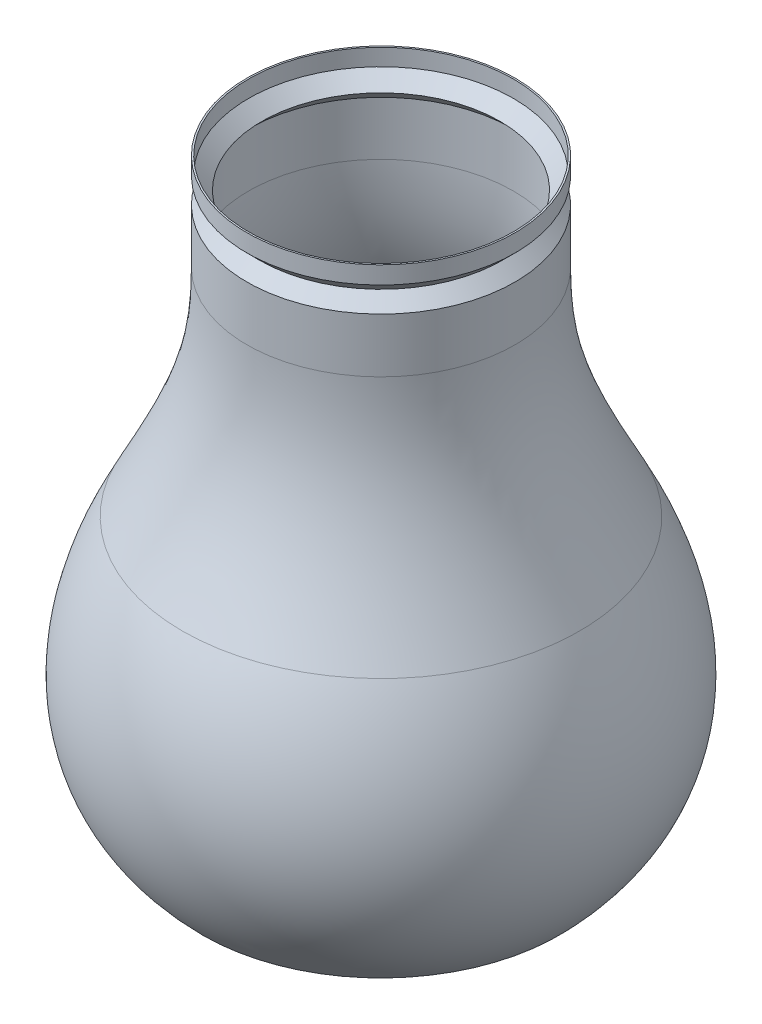
ISO-10303-21;
HEADER;
FILE_DESCRIPTION(('STEP AP214'),'2;1');
FILE_NAME('part.step','',(''),(''),'','','');
FILE_SCHEMA(('AUTOMOTIVE_DESIGN { 1 0 10303 214 1 1 1 1 }'));
ENDSEC;
DATA;
#1=APPLICATION_CONTEXT('core data for automotive mechanical design processes');
#2=APPLICATION_PROTOCOL_DEFINITION('international standard','automotive_design',2000,#1);
#3=PRODUCT_CONTEXT('',#1,'mechanical');
#4=PRODUCT('Part','Part','',(#3));
#5=PRODUCT_RELATED_PRODUCT_CATEGORY('part','',(#4));
#6=PRODUCT_DEFINITION_FORMATION('','',#4);
#7=PRODUCT_DEFINITION_CONTEXT('part definition',#1,'design');
#8=PRODUCT_DEFINITION('design','',#6,#7);
#9=PRODUCT_DEFINITION_SHAPE('','',#8);
#10=(LENGTH_UNIT() NAMED_UNIT(*) SI_UNIT(.MILLI.,.METRE.));
#11=(NAMED_UNIT(*) PLANE_ANGLE_UNIT() SI_UNIT($,.RADIAN.));
#12=(NAMED_UNIT(*) SI_UNIT($,.STERADIAN.) SOLID_ANGLE_UNIT());
#13=UNCERTAINTY_MEASURE_WITH_UNIT(LENGTH_MEASURE(1.E-05),#10,'distance_accuracy_value','');
#14=(GEOMETRIC_REPRESENTATION_CONTEXT(3) GLOBAL_UNCERTAINTY_ASSIGNED_CONTEXT((#13)) GLOBAL_UNIT_ASSIGNED_CONTEXT((#10,
#11,#12)) REPRESENTATION_CONTEXT('',''));
#15=CARTESIAN_POINT('',(0.,0.,0.));
#16=DIRECTION('',(0.,0.,1.));
#17=DIRECTION('',(1.,0.,0.));
#18=AXIS2_PLACEMENT_3D('',#15,#16,#17);
#19=CARTESIAN_POINT('',(0.,102.00575460953,0.));
#20=DIRECTION('',(0.,1.,0.));
#21=DIRECTION('',(0.,0.,1.));
#22=AXIS2_PLACEMENT_3D('',#19,#20,#21);
#23=PLANE('',#22);
#24=CARTESIAN_POINT('',(0.,102.00575460953,0.));
#25=DIRECTION('',(0.,-1.,0.));
#26=DIRECTION('',(0.,0.,-1.));
#27=AXIS2_PLACEMENT_3D('',#24,#25,#26);
#28=CIRCLE('',#27,32.6208653821263);
#29=CARTESIAN_POINT('',(0.,102.00575460953,-32.6208653821263));
#30=VERTEX_POINT('',#29);
#31=EDGE_CURVE('E10',#30,#30,#28,.T.);
#32=ORIENTED_EDGE('',*,*,#31,.T.);
#33=EDGE_LOOP('',(#32));
#34=FACE_BOUND('',#33,.T.);
#35=CARTESIAN_POINT('',(0.,102.00575460953,0.));
#36=DIRECTION('',(0.,-1.,0.));
#37=DIRECTION('',(0.,0.,-1.));
#38=AXIS2_PLACEMENT_3D('',#35,#36,#37);
#39=CIRCLE('',#38,33.0208653821263);
#40=CARTESIAN_POINT('',(0.,102.00575460953,-33.0208653821263));
#41=VERTEX_POINT('',#40);
#42=EDGE_CURVE('E119',#41,#41,#39,.T.);
#43=ORIENTED_EDGE('',*,*,#42,.F.);
#44=EDGE_LOOP('',(#43));
#45=FACE_BOUND('',#44,.T.);
#46=ADVANCED_FACE('F35',(#34,#45),#23,.T.);
#47=CARTESIAN_POINT('',(0.,0.,0.));
#48=DIRECTION('',(0.,-1.,0.));
#49=DIRECTION('',(0.,0.,-1.));
#50=AXIS2_PLACEMENT_3D('',#47,#48,#49);
#51=CYLINDRICAL_SURFACE('',#50,32.6208653821263);
#52=CARTESIAN_POINT('',(0.,97.85523123935,0.));
#53=DIRECTION('',(0.,1.,0.));
#54=DIRECTION('',(0.,0.,1.));
#55=AXIS2_PLACEMENT_3D('',#52,#53,#54);
#56=CIRCLE('',#55,32.6208653821263);
#57=CARTESIAN_POINT('',(0.,97.85523123935,32.6208653821263));
#58=VERTEX_POINT('',#57);
#59=EDGE_CURVE('E42',#58,#58,#56,.F.);
#60=ORIENTED_EDGE('',*,*,#59,.T.);
#61=EDGE_LOOP('',(#60));
#62=FACE_BOUND('',#61,.T.);
#63=ORIENTED_EDGE('',*,*,#31,.F.);
#64=EDGE_LOOP('',(#63));
#65=FACE_BOUND('',#64,.T.);
#66=ADVANCED_FACE('F109',(#62,#65),#51,.F.);
#67=CARTESIAN_POINT('',(0.,97.9723885268754,0.));
#68=DIRECTION('',(0.,1.,0.));
#69=DIRECTION('',(0.,0.,1.));
#70=AXIS2_PLACEMENT_3D('',#67,#68,#69);
#71=CONICAL_SURFACE('',#70,32.7380226696517,0.785398163397451);
#72=CARTESIAN_POINT('',(0.,94.5933034389735,0.));
#73=DIRECTION('',(0.,-1.,0.));
#74=DIRECTION('',(0.,0.,-1.));
#75=AXIS2_PLACEMENT_3D('',#72,#73,#74);
#76=CIRCLE('',#75,29.3589375817498);
#77=CARTESIAN_POINT('',(0.,94.5933034389735,-29.3589375817498));
#78=VERTEX_POINT('',#77);
#79=EDGE_CURVE('E47',#78,#78,#76,.T.);
#80=ORIENTED_EDGE('',*,*,#79,.T.);
#81=EDGE_LOOP('',(#80));
#82=FACE_BOUND('',#81,.T.);
#83=ORIENTED_EDGE('',*,*,#59,.F.);
#84=EDGE_LOOP('',(#83));
#85=FACE_BOUND('',#84,.T.);
#86=ADVANCED_FACE('F113',(#82,#85),#71,.F.);
#87=CARTESIAN_POINT('',(0.,94.3104607264989,0.));
#88=DIRECTION('',(0.,-1.,0.));
#89=DIRECTION('',(0.,0.,-1.));
#90=AXIS2_PLACEMENT_3D('',#87,#88,#89);
#91=CONICAL_SURFACE('',#90,29.6417802942244,0.785398163397447);
#92=CARTESIAN_POINT('',(0.,91.3313756385971,0.));
#93=DIRECTION('',(0.,-1.,0.));
#94=DIRECTION('',(0.,0.,-1.));
#95=AXIS2_PLACEMENT_3D('',#92,#93,#94);
#96=CIRCLE('',#95,32.6208653821263);
#97=CARTESIAN_POINT('',(0.,91.3313756385971,-32.6208653821263));
#98=VERTEX_POINT('',#97);
#99=EDGE_CURVE('E153',#98,#98,#96,.T.);
#100=ORIENTED_EDGE('',*,*,#99,.T.);
#101=EDGE_LOOP('',(#100));
#102=FACE_BOUND('',#101,.T.);
#103=ORIENTED_EDGE('',*,*,#79,.F.);
#104=EDGE_LOOP('',(#103));
#105=FACE_BOUND('',#104,.T.);
#106=ADVANCED_FACE('F163',(#102,#105),#91,.F.);
#107=CARTESIAN_POINT('',(0.,0.,0.));
#108=DIRECTION('',(0.,-1.,0.));
#109=DIRECTION('',(0.,0.,-1.));
#110=AXIS2_PLACEMENT_3D('',#107,#108,#109);
#111=CYLINDRICAL_SURFACE('',#110,32.6208653821263);
#112=CARTESIAN_POINT('',(0.,78.1039386954683,0.));
#113=DIRECTION('',(0.,-1.,0.));
#114=DIRECTION('',(0.,0.,-1.));
#115=AXIS2_PLACEMENT_3D('',#112,#113,#114);
#116=CIRCLE('',#115,32.6208653821263);
#117=CARTESIAN_POINT('',(0.,78.1039386954683,-32.6208653821263));
#118=VERTEX_POINT('',#117);
#119=EDGE_CURVE('E149',#118,#118,#116,.T.);
#120=ORIENTED_EDGE('',*,*,#119,.T.);
#121=EDGE_LOOP('',(#120));
#122=FACE_BOUND('',#121,.T.);
#123=ORIENTED_EDGE('',*,*,#99,.F.);
#124=EDGE_LOOP('',(#123));
#125=FACE_BOUND('',#124,.T.);
#126=ADVANCED_FACE('F165',(#122,#125),#111,.F.);
#127=CARTESIAN_POINT('',(33.0208653821263,78.1039386954683,0.));
#128=CARTESIAN_POINT('',(33.0208653821263,72.2834429102533,0.));
#129=CARTESIAN_POINT('',(34.2475435519663,53.9325972752835,0.));
#130=CARTESIAN_POINT('',(42.2309766532484,37.7958519504051,0.));
#131=CARTESIAN_POINT('',(48.9066919760712,25.0009727942814,0.));
#132=B_SPLINE_CURVE_WITH_KNOTS('',3,(#127,#128,#129,#130,#131),.UNSPECIFIED.,.F.,.F.,(4,1,4),
(0.,0.295134447110352,1.),.UNSPECIFIED.);
#133=CARTESIAN_POINT('',(0.,0.,0.));
#134=DIRECTION('',(0.,-1.,0.));
#135=AXIS1_PLACEMENT('',#133,#134);
#136=SURFACE_OF_REVOLUTION('',#132,#135);
#137=OFFSET_SURFACE('',#136,-0.4,.F.);
#138=CARTESIAN_POINT('',(0.,24.8159436422272,0.));
#139=DIRECTION('',(0.,-1.,0.));
#140=DIRECTION('',(1.,0.,0.));
#141=AXIS2_PLACEMENT_3D('',#138,#139,#140);
#142=CIRCLE('',#141,48.5520594720757);
#143=CARTESIAN_POINT('',(48.5520594720757,24.8159436422272,0.));
#144=VERTEX_POINT('',#143);
#145=EDGE_CURVE('E121',#144,#144,#142,.T.);
#146=ORIENTED_EDGE('',*,*,#145,.T.);
#147=EDGE_LOOP('',(#146));
#148=FACE_BOUND('',#147,.T.);
#149=ORIENTED_EDGE('',*,*,#119,.F.);
#150=EDGE_LOOP('',(#149));
#151=FACE_BOUND('',#150,.T.);
#152=ADVANCED_FACE('F73',(#148,#151),#137,.F.);
#153=CARTESIAN_POINT('',(48.9066919760712,25.0009727942814,0.));
#154=CARTESIAN_POINT('',(57.9528492630896,7.66283242766259,0.));
#155=CARTESIAN_POINT('',(61.1977338848295,-19.9772439432785,0.));
#156=CARTESIAN_POINT('',(49.9064141781168,-36.3791762064389,0.));
#157=CARTESIAN_POINT('',(43.8041132184263,-42.4814771661295,0.));
#158=B_SPLINE_CURVE_WITH_KNOTS('',3,(#153,#154,#155,#156,#157),.UNSPECIFIED.,.F.,.F.,(4,1,4),
(0.,0.5,1.),.UNSPECIFIED.);
#159=CARTESIAN_POINT('',(0.,0.,0.));
#160=DIRECTION('',(0.,-1.,0.));
#161=AXIS1_PLACEMENT('',#159,#160);
#162=SURFACE_OF_REVOLUTION('',#158,#161);
#163=OFFSET_SURFACE('',#162,-0.4,.F.);
#164=CARTESIAN_POINT('',(0.,-42.08147716613,0.));
#165=DIRECTION('',(0.,-1.,0.));
#166=DIRECTION('',(0.,0.,-1.));
#167=AXIS2_PLACEMENT_3D('',#164,#165,#166);
#168=CIRCLE('',#167,43.6381121545532);
#169=CARTESIAN_POINT('',(0.,-42.08147716613,-43.6381121545532));
#170=VERTEX_POINT('',#169);
#171=EDGE_CURVE('E51',#170,#170,#168,.T.);
#172=ORIENTED_EDGE('',*,*,#171,.T.);
#173=EDGE_LOOP('',(#172));
#174=FACE_BOUND('',#173,.T.);
#175=ORIENTED_EDGE('',*,*,#145,.F.);
#176=EDGE_LOOP('',(#175));
#177=FACE_BOUND('',#176,.T.);
#178=ADVANCED_FACE('F75',(#174,#177),#163,.F.);
#179=CARTESIAN_POINT('',(43.8041132184263,-42.08147716613,0.));
#180=DIRECTION('',(0.,1.,0.));
#181=DIRECTION('',(0.,0.,1.));
#182=AXIS2_PLACEMENT_3D('',#179,#180,#181);
#183=PLANE('',#182);
#184=ORIENTED_EDGE('',*,*,#171,.F.);
#185=EDGE_LOOP('',(#184));
#186=FACE_BOUND('',#185,.T.);
#187=ADVANCED_FACE('F78',(#186),#183,.T.);
#188=CARTESIAN_POINT('',(0.,0.,0.));
#189=DIRECTION('',(0.,-1.,0.));
#190=DIRECTION('',(0.,0.,-1.));
#191=AXIS2_PLACEMENT_3D('',#188,#189,#190);
#192=CYLINDRICAL_SURFACE('',#191,33.0208653821263);
#193=CARTESIAN_POINT('',(0.,97.6895458144008,0.));
#194=DIRECTION('',(0.,-1.,0.));
#195=DIRECTION('',(0.,0.,-1.));
#196=AXIS2_PLACEMENT_3D('',#193,#194,#195);
#197=CIRCLE('',#196,33.0208653821263);
#198=CARTESIAN_POINT('',(0.,97.6895458144008,-33.0208653821263));
#199=VERTEX_POINT('',#198);
#200=EDGE_CURVE('E38',#199,#199,#197,.T.);
#201=ORIENTED_EDGE('',*,*,#200,.F.);
#202=EDGE_LOOP('',(#201));
#203=FACE_BOUND('',#202,.T.);
#204=ORIENTED_EDGE('',*,*,#42,.T.);
#205=EDGE_LOOP('',(#204));
#206=FACE_BOUND('',#205,.T.);
#207=ADVANCED_FACE('F87',(#203,#206),#192,.T.);
#208=CARTESIAN_POINT('',(0.,97.6895458144008,0.));
#209=DIRECTION('',(0.,1.,0.));
#210=DIRECTION('',(0.,0.,1.));
#211=AXIS2_PLACEMENT_3D('',#208,#209,#210);
#212=CONICAL_SURFACE('',#211,33.0208653821263,0.785398163397451);
#213=CARTESIAN_POINT('',(0.,94.5933034389735,0.));
#214=DIRECTION('',(0.,-1.,0.));
#215=DIRECTION('',(0.,0.,-1.));
#216=AXIS2_PLACEMENT_3D('',#213,#214,#215);
#217=CIRCLE('',#216,29.924623006699);
#218=CARTESIAN_POINT('',(0.,94.5933034389735,-29.924623006699));
#219=VERTEX_POINT('',#218);
#220=EDGE_CURVE('E123',#219,#219,#217,.T.);
#221=ORIENTED_EDGE('',*,*,#220,.F.);
#222=EDGE_LOOP('',(#221));
#223=FACE_BOUND('',#222,.T.);
#224=ORIENTED_EDGE('',*,*,#200,.T.);
#225=EDGE_LOOP('',(#224));
#226=FACE_BOUND('',#225,.T.);
#227=ADVANCED_FACE('F98',(#223,#226),#212,.T.);
#228=CARTESIAN_POINT('',(0.,94.5933034389735,0.));
#229=DIRECTION('',(0.,-1.,0.));
#230=DIRECTION('',(0.,0.,-1.));
#231=AXIS2_PLACEMENT_3D('',#228,#229,#230);
#232=CONICAL_SURFACE('',#231,29.924623006699,0.785398163397447);
#233=CARTESIAN_POINT('',(0.,91.4970610635463,0.));
#234=DIRECTION('',(0.,-1.,0.));
#235=DIRECTION('',(0.,0.,-1.));
#236=AXIS2_PLACEMENT_3D('',#233,#234,#235);
#237=CIRCLE('',#236,33.0208653821263);
#238=CARTESIAN_POINT('',(0.,91.4970610635463,-33.0208653821263));
#239=VERTEX_POINT('',#238);
#240=EDGE_CURVE('E127',#239,#239,#237,.T.);
#241=ORIENTED_EDGE('',*,*,#240,.F.);
#242=EDGE_LOOP('',(#241));
#243=FACE_BOUND('',#242,.T.);
#244=ORIENTED_EDGE('',*,*,#220,.T.);
#245=EDGE_LOOP('',(#244));
#246=FACE_BOUND('',#245,.T.);
#247=ADVANCED_FACE('F94',(#243,#246),#232,.T.);
#248=CARTESIAN_POINT('',(0.,0.,0.));
#249=DIRECTION('',(0.,-1.,0.));
#250=DIRECTION('',(0.,0.,-1.));
#251=AXIS2_PLACEMENT_3D('',#248,#249,#250);
#252=CYLINDRICAL_SURFACE('',#251,33.0208653821263);
#253=CARTESIAN_POINT('',(0.,78.1039386954683,0.));
#254=DIRECTION('',(0.,-1.,0.));
#255=DIRECTION('',(0.,0.,-1.));
#256=AXIS2_PLACEMENT_3D('',#253,#254,#255);
#257=CIRCLE('',#256,33.0208653821263);
#258=CARTESIAN_POINT('',(0.,78.1039386954683,-33.0208653821263));
#259=VERTEX_POINT('',#258);
#260=EDGE_CURVE('E130',#259,#259,#257,.T.);
#261=ORIENTED_EDGE('',*,*,#260,.F.);
#262=EDGE_LOOP('',(#261));
#263=FACE_BOUND('',#262,.T.);
#264=ORIENTED_EDGE('',*,*,#240,.T.);
#265=EDGE_LOOP('',(#264));
#266=FACE_BOUND('',#265,.T.);
#267=ADVANCED_FACE('F71',(#263,#266),#252,.T.);
#268=CARTESIAN_POINT('',(33.0208653821263,78.1039386954683,0.));
#269=CARTESIAN_POINT('',(33.0208653821263,72.2834429102533,0.));
#270=CARTESIAN_POINT('',(34.2475435519663,53.9325972752835,0.));
#271=CARTESIAN_POINT('',(42.2309766532484,37.7958519504051,0.));
#272=CARTESIAN_POINT('',(48.9066919760712,25.0009727942814,0.));
#273=B_SPLINE_CURVE_WITH_KNOTS('',3,(#268,#269,#270,#271,#272),.UNSPECIFIED.,.F.,.F.,(4,1,4),
(0.,0.295134447110352,1.),.UNSPECIFIED.);
#274=CARTESIAN_POINT('',(0.,0.,0.));
#275=DIRECTION('',(0.,-1.,0.));
#276=AXIS1_PLACEMENT('',#274,#275);
#277=SURFACE_OF_REVOLUTION('',#273,#276);
#278=CARTESIAN_POINT('',(0.,25.0009727942814,0.));
#279=DIRECTION('',(0.,-1.,0.));
#280=DIRECTION('',(0.,0.,-1.));
#281=AXIS2_PLACEMENT_3D('',#278,#279,#280);
#282=CIRCLE('',#281,48.9066919760712);
#283=CARTESIAN_POINT('',(0.,25.0009727942814,-48.9066919760712));
#284=VERTEX_POINT('',#283);
#285=EDGE_CURVE('E133',#284,#284,#282,.T.);
#286=ORIENTED_EDGE('',*,*,#285,.F.);
#287=EDGE_LOOP('',(#286));
#288=FACE_BOUND('',#287,.T.);
#289=ORIENTED_EDGE('',*,*,#260,.T.);
#290=EDGE_LOOP('',(#289));
#291=FACE_BOUND('',#290,.T.);
#292=ADVANCED_FACE('F65',(#288,#291),#277,.T.);
#293=CARTESIAN_POINT('',(48.9066919760712,25.0009727942814,0.));
#294=CARTESIAN_POINT('',(57.9528492630896,7.66283242766259,0.));
#295=CARTESIAN_POINT('',(61.1977338848295,-19.9772439432785,0.));
#296=CARTESIAN_POINT('',(49.9064141781168,-36.3791762064389,0.));
#297=CARTESIAN_POINT('',(43.8041132184263,-42.4814771661295,0.));
#298=B_SPLINE_CURVE_WITH_KNOTS('',3,(#293,#294,#295,#296,#297),.UNSPECIFIED.,.F.,.F.,(4,1,4),
(0.,0.5,1.),.UNSPECIFIED.);
#299=CARTESIAN_POINT('',(0.,0.,0.));
#300=DIRECTION('',(0.,-1.,0.));
#301=AXIS1_PLACEMENT('',#299,#300);
#302=SURFACE_OF_REVOLUTION('',#298,#301);
#303=CARTESIAN_POINT('',(0.,-42.4814771661295,0.));
#304=DIRECTION('',(0.,-1.,0.));
#305=DIRECTION('',(0.,0.,-1.));
#306=AXIS2_PLACEMENT_3D('',#303,#304,#305);
#307=CIRCLE('',#306,43.8041132184263);
#308=CARTESIAN_POINT('',(0.,-42.4814771661295,-43.8041132184263));
#309=VERTEX_POINT('',#308);
#310=EDGE_CURVE('E135',#309,#309,#307,.T.);
#311=ORIENTED_EDGE('',*,*,#310,.F.);
#312=EDGE_LOOP('',(#311));
#313=FACE_BOUND('',#312,.T.);
#314=ORIENTED_EDGE('',*,*,#285,.T.);
#315=EDGE_LOOP('',(#314));
#316=FACE_BOUND('',#315,.T.);
#317=ADVANCED_FACE('F70',(#313,#316),#302,.T.);
#318=CARTESIAN_POINT('',(43.8041132184263,-42.48147716613,0.));
#319=DIRECTION('',(0.,1.,0.));
#320=DIRECTION('',(0.,0.,1.));
#321=AXIS2_PLACEMENT_3D('',#318,#319,#320);
#322=PLANE('',#321);
#323=ORIENTED_EDGE('',*,*,#310,.T.);
#324=EDGE_LOOP('',(#323));
#325=FACE_BOUND('',#324,.T.);
#326=ADVANCED_FACE('F83',(#325),#322,.F.);
#327=CLOSED_SHELL('',(#46,#66,#86,#106,#126,#152,#178,#187,#207,#227,#247,#267,#292,#317,#326));
#328=MANIFOLD_SOLID_BREP('B2',#327);
#329=ADVANCED_BREP_SHAPE_REPRESENTATION('',(#18,#328),#14);
#330=SHAPE_DEFINITION_REPRESENTATION(#9,#329);
ENDSEC;
END-ISO-10303-21;
